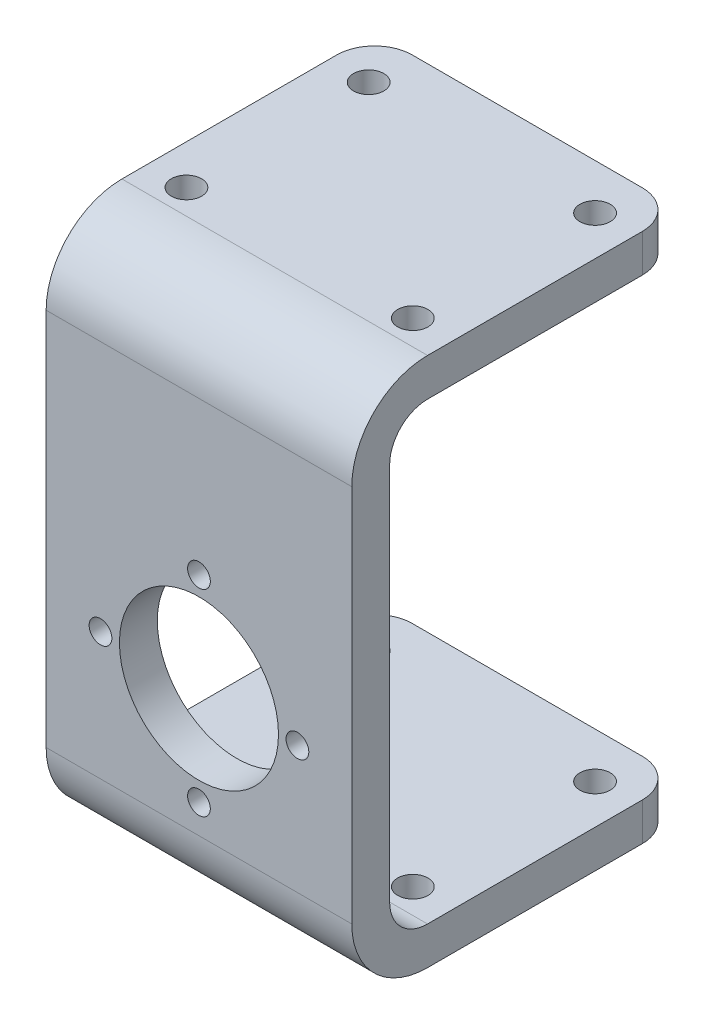
ISO-10303-21;
HEADER;
FILE_DESCRIPTION(('STEP AP214'),'2;1');
FILE_NAME('part.step','',(''),(''),'','','');
FILE_SCHEMA(('AUTOMOTIVE_DESIGN { 1 0 10303 214 1 1 1 1 }'));
ENDSEC;
DATA;
#1=APPLICATION_CONTEXT('core data for automotive mechanical design processes');
#2=APPLICATION_PROTOCOL_DEFINITION('international standard','automotive_design',2000,#1);
#3=PRODUCT_CONTEXT('',#1,'mechanical');
#4=PRODUCT('Part','Part','',(#3));
#5=PRODUCT_RELATED_PRODUCT_CATEGORY('part','',(#4));
#6=PRODUCT_DEFINITION_FORMATION('','',#4);
#7=PRODUCT_DEFINITION_CONTEXT('part definition',#1,'design');
#8=PRODUCT_DEFINITION('design','',#6,#7);
#9=PRODUCT_DEFINITION_SHAPE('','',#8);
#10=(LENGTH_UNIT() NAMED_UNIT(*) SI_UNIT(.MILLI.,.METRE.));
#11=(NAMED_UNIT(*) PLANE_ANGLE_UNIT() SI_UNIT($,.RADIAN.));
#12=(NAMED_UNIT(*) SI_UNIT($,.STERADIAN.) SOLID_ANGLE_UNIT());
#13=UNCERTAINTY_MEASURE_WITH_UNIT(LENGTH_MEASURE(1.E-05),#10,'distance_accuracy_value','');
#14=(GEOMETRIC_REPRESENTATION_CONTEXT(3) GLOBAL_UNCERTAINTY_ASSIGNED_CONTEXT((#13)) GLOBAL_UNIT_ASSIGNED_CONTEXT((#10,
#11,#12)) REPRESENTATION_CONTEXT('',''));
#15=CARTESIAN_POINT('',(0.,0.,0.));
#16=DIRECTION('',(0.,0.,1.));
#17=DIRECTION('',(1.,0.,0.));
#18=AXIS2_PLACEMENT_3D('',#15,#16,#17);
#19=CARTESIAN_POINT('',(-47.1412127925836,47.,50.783023222912));
#20=DIRECTION('',(0.,0.,-1.));
#21=DIRECTION('',(-1.,0.,0.));
#22=AXIS2_PLACEMENT_3D('',#19,#20,#21);
#23=PLANE('',#22);
#24=CARTESIAN_POINT('',(-26.9662127925835,39.8250000000002,50.783023222912));
#25=DIRECTION('',(0.,0.,1.));
#26=DIRECTION('',(1.,0.,0.));
#27=AXIS2_PLACEMENT_3D('',#24,#25,#26);
#28=CIRCLE('',#27,1.49999999999991);
#29=CARTESIAN_POINT('',(-25.4662127925835,39.8250000000002,50.783023222912));
#30=VERTEX_POINT('',#29);
#31=EDGE_CURVE('E604',#30,#30,#28,.T.);
#32=ORIENTED_EDGE('',*,*,#31,.F.);
#33=EDGE_LOOP('',(#32));
#34=FACE_BOUND('',#33,.T.);
#35=CARTESIAN_POINT('',(-26.9662127925833,13.825,50.783023222912));
#36=DIRECTION('',(0.,0.,1.));
#37=DIRECTION('',(1.,0.,0.));
#38=AXIS2_PLACEMENT_3D('',#35,#36,#37);
#39=CIRCLE('',#38,1.5);
#40=CARTESIAN_POINT('',(-25.4662127925833,13.825,50.783023222912));
#41=VERTEX_POINT('',#40);
#42=EDGE_CURVE('E369',#41,#41,#39,.T.);
#43=ORIENTED_EDGE('',*,*,#42,.F.);
#44=EDGE_LOOP('',(#43));
#45=FACE_BOUND('',#44,.T.);
#46=CARTESIAN_POINT('',(-39.9662127925834,26.8249999999999,50.783023222912));
#47=DIRECTION('',(0.,0.,1.));
#48=DIRECTION('',(1.,0.,0.));
#49=AXIS2_PLACEMENT_3D('',#46,#47,#48);
#50=CIRCLE('',#49,1.5);
#51=CARTESIAN_POINT('',(-38.4662127925834,26.8249999999999,50.783023222912));
#52=VERTEX_POINT('',#51);
#53=EDGE_CURVE('E371',#52,#52,#50,.T.);
#54=ORIENTED_EDGE('',*,*,#53,.F.);
#55=EDGE_LOOP('',(#54));
#56=FACE_BOUND('',#55,.T.);
#57=CARTESIAN_POINT('',(-26.9662127925836,26.825,50.783023222912));
#58=DIRECTION('',(0.,0.,1.));
#59=DIRECTION('',(1.,0.,0.));
#60=AXIS2_PLACEMENT_3D('',#57,#58,#59);
#61=CIRCLE('',#60,10.5);
#62=CARTESIAN_POINT('',(-16.4662127925836,26.825,50.783023222912));
#63=VERTEX_POINT('',#62);
#64=EDGE_CURVE('E275',#63,#63,#61,.T.);
#65=ORIENTED_EDGE('',*,*,#64,.F.);
#66=EDGE_LOOP('',(#65));
#67=FACE_BOUND('',#66,.T.);
#68=CARTESIAN_POINT('',(-13.9662127925834,26.8250000000001,50.783023222912));
#69=DIRECTION('',(0.,0.,1.));
#70=DIRECTION('',(1.,0.,0.));
#71=AXIS2_PLACEMENT_3D('',#68,#69,#70);
#72=CIRCLE('',#71,1.5);
#73=CARTESIAN_POINT('',(-12.4662127925834,26.8250000000001,50.783023222912));
#74=VERTEX_POINT('',#73);
#75=EDGE_CURVE('E375',#74,#74,#72,.T.);
#76=ORIENTED_EDGE('',*,*,#75,.F.);
#77=EDGE_LOOP('',(#76));
#78=FACE_BOUND('',#77,.T.);
#79=DIRECTION('',(1.,0.,0.));
#80=VECTOR('',#79,1.);
#81=CARTESIAN_POINT('',(-56.7912127925836,59.9971782264075,50.783023222912));
#82=LINE('',#81,#80);
#83=CARTESIAN_POINT('',(-47.1412127925836,59.9971782264075,50.783023222912));
#84=VERTEX_POINT('',#83);
#85=CARTESIAN_POINT('',(-6.79121279258359,59.9971782264075,50.783023222912));
#86=VERTEX_POINT('',#85);
#87=EDGE_CURVE('E184',#84,#86,#82,.T.);
#88=ORIENTED_EDGE('',*,*,#87,.F.);
#89=DIRECTION('',(0.,-1.,0.));
#90=VECTOR('',#89,1.);
#91=CARTESIAN_POINT('',(-47.1412127925836,47.,50.783023222912));
#92=LINE('',#91,#90);
#93=CARTESIAN_POINT('',(-47.1412127925836,10.,50.783023222912));
#94=VERTEX_POINT('',#93);
#95=EDGE_CURVE('E212',#84,#94,#92,.T.);
#96=ORIENTED_EDGE('',*,*,#95,.T.);
#97=DIRECTION('',(1.,0.,0.));
#98=VECTOR('',#97,1.);
#99=CARTESIAN_POINT('',(-47.1412127925836,10.,50.783023222912));
#100=LINE('',#99,#98);
#101=CARTESIAN_POINT('',(-6.79121279258359,10.,50.783023222912));
#102=VERTEX_POINT('',#101);
#103=EDGE_CURVE('E210',#94,#102,#100,.T.);
#104=ORIENTED_EDGE('',*,*,#103,.T.);
#105=DIRECTION('',(0.,-1.,0.));
#106=VECTOR('',#105,1.);
#107=CARTESIAN_POINT('',(-6.79121279258359,47.,50.783023222912));
#108=LINE('',#107,#106);
#109=EDGE_CURVE('E201',#86,#102,#108,.T.);
#110=ORIENTED_EDGE('',*,*,#109,.F.);
#111=EDGE_LOOP('',(#88,#96,#104,#110));
#112=FACE_BOUND('',#111,.T.);
#113=ADVANCED_FACE('F68',(#34,#45,#56,#67,#78,#112),#23,.F.);
#114=CARTESIAN_POINT('',(-47.1412127925836,47.,7.43302322291196));
#115=DIRECTION('',(1.,0.,0.));
#116=DIRECTION('',(0.,0.,-1.));
#117=AXIS2_PLACEMENT_3D('',#114,#115,#116);
#118=PLANE('',#117);
#119=DIRECTION('',(0.,0.,-1.));
#120=VECTOR('',#119,1.);
#121=CARTESIAN_POINT('',(-47.1412127925836,70.,50.783023222912));
#122=LINE('',#121,#120);
#123=CARTESIAN_POINT('',(-47.1412127925836,70.,40.7802014493195));
#124=VERTEX_POINT('',#123);
#125=CARTESIAN_POINT('',(-47.1412127925836,70.,12.433023222912));
#126=VERTEX_POINT('',#125);
#127=EDGE_CURVE('E357',#124,#126,#122,.T.);
#128=ORIENTED_EDGE('',*,*,#127,.T.);
#129=DIRECTION('',(0.,-1.,0.));
#130=VECTOR('',#129,1.);
#131=CARTESIAN_POINT('',(-47.1412127925836,47.,12.433023222912));
#132=LINE('',#131,#130);
#133=CARTESIAN_POINT('',(-47.1412127925836,65.0000022878821,12.433023222912));
#134=VERTEX_POINT('',#133);
#135=EDGE_CURVE('E12',#126,#134,#132,.T.);
#136=ORIENTED_EDGE('',*,*,#135,.T.);
#137=DIRECTION('',(0.,0.,1.));
#138=VECTOR('',#137,1.);
#139=CARTESIAN_POINT('',(-47.1412127925836,65.0000022878821,7.43302322291196));
#140=LINE('',#139,#138);
#141=CARTESIAN_POINT('',(-47.1412127925836,65.0000022878821,40.7778088979855));
#142=VERTEX_POINT('',#141);
#143=EDGE_CURVE('E474',#134,#142,#140,.T.);
#144=ORIENTED_EDGE('',*,*,#143,.T.);
#145=CARTESIAN_POINT('',(-47.1412127925836,59.9947856750735,40.7778088979856));
#146=DIRECTION('',(1.,0.,0.));
#147=DIRECTION('',(0.,0.,-1.));
#148=AXIS2_PLACEMENT_3D('',#145,#146,#147);
#149=CIRCLE('',#148,5.00521661280863);
#150=CARTESIAN_POINT('',(-47.1412127925836,59.9995713501471,45.7830232229121));
#151=VERTEX_POINT('',#150);
#152=EDGE_CURVE('E293',#142,#151,#149,.T.);
#153=ORIENTED_EDGE('',*,*,#152,.T.);
#154=DIRECTION('',(0.,1.,0.));
#155=VECTOR('',#154,1.);
#156=CARTESIAN_POINT('',(-47.1412127925836,0.,45.783023222912));
#157=LINE('',#156,#155);
#158=CARTESIAN_POINT('',(-47.1412127925836,10.,45.783023222912));
#159=VERTEX_POINT('',#158);
#160=EDGE_CURVE('E388',#159,#151,#157,.T.);
#161=ORIENTED_EDGE('',*,*,#160,.F.);
#162=CARTESIAN_POINT('',(-47.1412127925836,10.,40.783023222912));
#163=DIRECTION('',(-1.,0.,0.));
#164=DIRECTION('',(0.,0.,1.));
#165=AXIS2_PLACEMENT_3D('',#162,#163,#164);
#166=CIRCLE('',#165,5.);
#167=CARTESIAN_POINT('',(-47.1412127925836,5.,40.783023222912));
#168=VERTEX_POINT('',#167);
#169=EDGE_CURVE('E287',#168,#159,#166,.T.);
#170=ORIENTED_EDGE('',*,*,#169,.F.);
#171=DIRECTION('',(0.,0.,1.));
#172=VECTOR('',#171,1.);
#173=CARTESIAN_POINT('',(-47.1412127925836,5.,0.));
#174=LINE('',#173,#172);
#175=CARTESIAN_POINT('',(-47.1412127925836,5.,12.433023222912));
#176=VERTEX_POINT('',#175);
#177=EDGE_CURVE('E391',#176,#168,#174,.T.);
#178=ORIENTED_EDGE('',*,*,#177,.F.);
#179=DIRECTION('',(0.,-1.,0.));
#180=VECTOR('',#179,1.);
#181=CARTESIAN_POINT('',(-47.1412127925836,47.,12.433023222912));
#182=LINE('',#181,#180);
#183=CARTESIAN_POINT('',(-47.1412127925836,0.,12.433023222912));
#184=VERTEX_POINT('',#183);
#185=EDGE_CURVE('E265',#176,#184,#182,.T.);
#186=ORIENTED_EDGE('',*,*,#185,.T.);
#187=DIRECTION('',(0.,0.,1.));
#188=VECTOR('',#187,1.);
#189=CARTESIAN_POINT('',(-47.1412127925836,0.,7.43302322291196));
#190=LINE('',#189,#188);
#191=CARTESIAN_POINT('',(-47.1412127925836,0.,40.783023222912));
#192=VERTEX_POINT('',#191);
#193=EDGE_CURVE('E408',#184,#192,#190,.T.);
#194=ORIENTED_EDGE('',*,*,#193,.T.);
#195=CARTESIAN_POINT('',(-47.1412127925836,10.,40.783023222912));
#196=DIRECTION('',(1.,0.,0.));
#197=DIRECTION('',(0.,0.,-1.));
#198=AXIS2_PLACEMENT_3D('',#195,#196,#197);
#199=CIRCLE('',#198,10.);
#200=EDGE_CURVE('E232',#192,#94,#199,.F.);
#201=ORIENTED_EDGE('',*,*,#200,.T.);
#202=ORIENTED_EDGE('',*,*,#95,.F.);
#203=CARTESIAN_POINT('',(-47.1412127925836,59.9971782264075,40.7802014493195));
#204=DIRECTION('',(1.,0.,0.));
#205=DIRECTION('',(0.,0.,-1.));
#206=AXIS2_PLACEMENT_3D('',#203,#204,#205);
#207=CIRCLE('',#206,10.0028217735925);
#208=EDGE_CURVE('E190',#124,#84,#207,.T.);
#209=ORIENTED_EDGE('',*,*,#208,.F.);
#210=EDGE_LOOP('',(#128,#136,#144,#153,#161,#170,#178,#186,#194,#201,#202,#209));
#211=FACE_BOUND('',#210,.T.);
#212=ADVANCED_FACE('F436',(#211),#118,.F.);
#213=CARTESIAN_POINT('',(-6.7912127925836,47.,7.43302322291196));
#214=DIRECTION('',(-1.,0.,0.));
#215=DIRECTION('',(0.,0.,1.));
#216=AXIS2_PLACEMENT_3D('',#213,#214,#215);
#217=PLANE('',#216);
#218=DIRECTION('',(0.,0.,1.));
#219=VECTOR('',#218,1.);
#220=CARTESIAN_POINT('',(-6.7912127925836,65.0000022878821,0.));
#221=LINE('',#220,#219);
#222=CARTESIAN_POINT('',(-6.7912127925836,65.0000022878821,12.433023222912));
#223=VERTEX_POINT('',#222);
#224=CARTESIAN_POINT('',(-6.7912127925836,65.0000022878821,40.7778088979855));
#225=VERTEX_POINT('',#224);
#226=EDGE_CURVE('E195',#223,#225,#221,.T.);
#227=ORIENTED_EDGE('',*,*,#226,.F.);
#228=DIRECTION('',(0.,1.,0.));
#229=VECTOR('',#228,1.);
#230=CARTESIAN_POINT('',(-6.7912127925836,47.,12.433023222912));
#231=LINE('',#230,#229);
#232=CARTESIAN_POINT('',(-6.7912127925836,70.,12.433023222912));
#233=VERTEX_POINT('',#232);
#234=EDGE_CURVE('E320',#223,#233,#231,.T.);
#235=ORIENTED_EDGE('',*,*,#234,.T.);
#236=DIRECTION('',(0.,0.,-1.));
#237=VECTOR('',#236,1.);
#238=CARTESIAN_POINT('',(-6.79121279258359,70.,50.783023222912));
#239=LINE('',#238,#237);
#240=CARTESIAN_POINT('',(-6.7912127925836,70.,40.7802014493195));
#241=VERTEX_POINT('',#240);
#242=EDGE_CURVE('E205',#241,#233,#239,.T.);
#243=ORIENTED_EDGE('',*,*,#242,.F.);
#244=CARTESIAN_POINT('',(-6.7912127925836,59.9971782264075,40.7802014493195));
#245=DIRECTION('',(1.,0.,0.));
#246=DIRECTION('',(0.,0.,-1.));
#247=AXIS2_PLACEMENT_3D('',#244,#245,#246);
#248=CIRCLE('',#247,10.0028217735925);
#249=EDGE_CURVE('E187',#241,#86,#248,.T.);
#250=ORIENTED_EDGE('',*,*,#249,.T.);
#251=ORIENTED_EDGE('',*,*,#109,.T.);
#252=CARTESIAN_POINT('',(-6.79121279258359,10.,40.783023222912));
#253=DIRECTION('',(-1.,0.,0.));
#254=DIRECTION('',(0.,0.,1.));
#255=AXIS2_PLACEMENT_3D('',#252,#253,#254);
#256=CIRCLE('',#255,10.);
#257=CARTESIAN_POINT('',(-6.7912127925836,0.,40.783023222912));
#258=VERTEX_POINT('',#257);
#259=EDGE_CURVE('E225',#102,#258,#256,.F.);
#260=ORIENTED_EDGE('',*,*,#259,.T.);
#261=DIRECTION('',(0.,0.,-1.));
#262=VECTOR('',#261,1.);
#263=CARTESIAN_POINT('',(-6.7912127925836,0.,7.43302322291196));
#264=LINE('',#263,#262);
#265=CARTESIAN_POINT('',(-6.7912127925836,0.,12.433023222912));
#266=VERTEX_POINT('',#265);
#267=EDGE_CURVE('E219',#258,#266,#264,.T.);
#268=ORIENTED_EDGE('',*,*,#267,.T.);
#269=DIRECTION('',(0.,-1.,0.));
#270=VECTOR('',#269,1.);
#271=CARTESIAN_POINT('',(-6.7912127925836,47.,12.433023222912));
#272=LINE('',#271,#270);
#273=CARTESIAN_POINT('',(-6.7912127925836,5.,12.433023222912));
#274=VERTEX_POINT('',#273);
#275=EDGE_CURVE('E256',#266,#274,#272,.F.);
#276=ORIENTED_EDGE('',*,*,#275,.T.);
#277=DIRECTION('',(0.,0.,1.));
#278=VECTOR('',#277,1.);
#279=CARTESIAN_POINT('',(-6.7912127925836,5.,7.43302322291196));
#280=LINE('',#279,#278);
#281=CARTESIAN_POINT('',(-6.7912127925836,5.,40.783023222912));
#282=VERTEX_POINT('',#281);
#283=EDGE_CURVE('E240',#274,#282,#280,.T.);
#284=ORIENTED_EDGE('',*,*,#283,.T.);
#285=CARTESIAN_POINT('',(-6.79121279258359,10.,40.783023222912));
#286=DIRECTION('',(-1.,0.,0.));
#287=DIRECTION('',(0.,0.,1.));
#288=AXIS2_PLACEMENT_3D('',#285,#286,#287);
#289=CIRCLE('',#288,5.);
#290=CARTESIAN_POINT('',(-6.79121279258359,10.,45.783023222912));
#291=VERTEX_POINT('',#290);
#292=EDGE_CURVE('E236',#282,#291,#289,.T.);
#293=ORIENTED_EDGE('',*,*,#292,.T.);
#294=DIRECTION('',(0.,1.,0.));
#295=VECTOR('',#294,1.);
#296=CARTESIAN_POINT('',(-6.7912127925836,47.,45.783023222912));
#297=LINE('',#296,#295);
#298=CARTESIAN_POINT('',(-6.79121279258359,59.9995713501471,45.7830232229121));
#299=VERTEX_POINT('',#298);
#300=EDGE_CURVE('E399',#291,#299,#297,.T.);
#301=ORIENTED_EDGE('',*,*,#300,.T.);
#302=CARTESIAN_POINT('',(-6.7912127925836,59.9947856750735,40.7778088979856));
#303=DIRECTION('',(1.,0.,0.));
#304=DIRECTION('',(0.,0.,-1.));
#305=AXIS2_PLACEMENT_3D('',#302,#303,#304);
#306=CIRCLE('',#305,5.00521661280863);
#307=EDGE_CURVE('E346',#225,#299,#306,.T.);
#308=ORIENTED_EDGE('',*,*,#307,.F.);
#309=EDGE_LOOP('',(#227,#235,#243,#250,#251,#260,#268,#276,#284,#293,#301,#308));
#310=FACE_BOUND('',#309,.T.);
#311=ADVANCED_FACE('F200',(#310),#217,.F.);
#312=CARTESIAN_POINT('',(-6.79121279258359,70.,50.783023222912));
#313=DIRECTION('',(0.,1.,0.));
#314=DIRECTION('',(0.,0.,1.));
#315=AXIS2_PLACEMENT_3D('',#312,#313,#314);
#316=PLANE('',#315);
#317=CARTESIAN_POINT('',(-41.9112127925836,70.,37.493023222912));
#318=DIRECTION('',(0.,1.,0.));
#319=DIRECTION('',(0.,0.,1.));
#320=AXIS2_PLACEMENT_3D('',#317,#318,#319);
#321=CIRCLE('',#320,2.);
#322=CARTESIAN_POINT('',(-41.9112127925836,70.,39.493023222912));
#323=VERTEX_POINT('',#322);
#324=EDGE_CURVE('E306',#323,#323,#321,.F.);
#325=ORIENTED_EDGE('',*,*,#324,.T.);
#326=EDGE_LOOP('',(#325));
#327=FACE_BOUND('',#326,.T.);
#328=CARTESIAN_POINT('',(-12.0212127925836,70.,13.433023222912));
#329=DIRECTION('',(0.,1.,0.));
#330=DIRECTION('',(0.,0.,1.));
#331=AXIS2_PLACEMENT_3D('',#328,#329,#330);
#332=CIRCLE('',#331,2.);
#333=CARTESIAN_POINT('',(-12.0212127925836,70.,15.433023222912));
#334=VERTEX_POINT('',#333);
#335=EDGE_CURVE('E300',#334,#334,#332,.F.);
#336=ORIENTED_EDGE('',*,*,#335,.T.);
#337=EDGE_LOOP('',(#336));
#338=FACE_BOUND('',#337,.T.);
#339=CARTESIAN_POINT('',(-41.9112127925836,70.,13.433023222912));
#340=DIRECTION('',(0.,1.,0.));
#341=DIRECTION('',(0.,0.,1.));
#342=AXIS2_PLACEMENT_3D('',#339,#340,#341);
#343=CIRCLE('',#342,2.);
#344=CARTESIAN_POINT('',(-41.9112127925836,70.,15.433023222912));
#345=VERTEX_POINT('',#344);
#346=EDGE_CURVE('E294',#345,#345,#343,.F.);
#347=ORIENTED_EDGE('',*,*,#346,.T.);
#348=EDGE_LOOP('',(#347));
#349=FACE_BOUND('',#348,.T.);
#350=CARTESIAN_POINT('',(-12.0212127925836,70.,37.493023222912));
#351=DIRECTION('',(0.,1.,0.));
#352=DIRECTION('',(0.,0.,1.));
#353=AXIS2_PLACEMENT_3D('',#350,#351,#352);
#354=CIRCLE('',#353,2.);
#355=CARTESIAN_POINT('',(-12.0212127925836,70.,39.493023222912));
#356=VERTEX_POINT('',#355);
#357=EDGE_CURVE('E288',#356,#356,#354,.F.);
#358=ORIENTED_EDGE('',*,*,#357,.T.);
#359=EDGE_LOOP('',(#358));
#360=FACE_BOUND('',#359,.T.);
#361=ORIENTED_EDGE('',*,*,#242,.T.);
#362=CARTESIAN_POINT('',(-11.7912127925836,70.,12.433023222912));
#363=DIRECTION('',(0.,1.,0.));
#364=DIRECTION('',(0.,0.,1.));
#365=AXIS2_PLACEMENT_3D('',#362,#363,#364);
#366=CIRCLE('',#365,5.);
#367=CARTESIAN_POINT('',(-11.7912127925836,70.,7.43302322291196));
#368=VERTEX_POINT('',#367);
#369=EDGE_CURVE('E326',#233,#368,#366,.T.);
#370=ORIENTED_EDGE('',*,*,#369,.T.);
#371=DIRECTION('',(-1.,0.,0.));
#372=VECTOR('',#371,1.);
#373=CARTESIAN_POINT('',(-6.79121279258361,70.,7.43302322291196));
#374=LINE('',#373,#372);
#375=CARTESIAN_POINT('',(-42.1412127925836,70.,7.43302322291196));
#376=VERTEX_POINT('',#375);
#377=EDGE_CURVE('E353',#368,#376,#374,.T.);
#378=ORIENTED_EDGE('',*,*,#377,.T.);
#379=CARTESIAN_POINT('',(-42.1412127925836,70.,12.433023222912));
#380=DIRECTION('',(0.,1.,0.));
#381=DIRECTION('',(0.,0.,1.));
#382=AXIS2_PLACEMENT_3D('',#379,#380,#381);
#383=CIRCLE('',#382,5.);
#384=EDGE_CURVE('E323',#376,#126,#383,.T.);
#385=ORIENTED_EDGE('',*,*,#384,.T.);
#386=ORIENTED_EDGE('',*,*,#127,.F.);
#387=DIRECTION('',(1.,0.,0.));
#388=VECTOR('',#387,1.);
#389=CARTESIAN_POINT('',(-56.7912127925836,70.,40.7802014493195));
#390=LINE('',#389,#388);
#391=EDGE_CURVE('E269',#124,#241,#390,.T.);
#392=ORIENTED_EDGE('',*,*,#391,.T.);
#393=EDGE_LOOP('',(#361,#370,#378,#385,#386,#392));
#394=FACE_BOUND('',#393,.T.);
#395=ADVANCED_FACE('F352',(#327,#338,#349,#360,#394),#316,.T.);
#396=CARTESIAN_POINT('',(-47.1412127925836,47.,7.43302322291196));
#397=DIRECTION('',(0.,0.,1.));
#398=DIRECTION('',(1.,0.,0.));
#399=AXIS2_PLACEMENT_3D('',#396,#397,#398);
#400=PLANE('',#399);
#401=DIRECTION('',(1.,0.,0.));
#402=VECTOR('',#401,1.);
#403=CARTESIAN_POINT('',(-47.1412127925836,5.,7.43302322291196));
#404=LINE('',#403,#402);
#405=CARTESIAN_POINT('',(-42.1412127925836,5.,7.43302322291196));
#406=VERTEX_POINT('',#405);
#407=CARTESIAN_POINT('',(-11.7912127925836,5.,7.43302322291196));
#408=VERTEX_POINT('',#407);
#409=EDGE_CURVE('E404',#406,#408,#404,.T.);
#410=ORIENTED_EDGE('',*,*,#409,.T.);
#411=DIRECTION('',(0.,-1.,0.));
#412=VECTOR('',#411,1.);
#413=CARTESIAN_POINT('',(-11.7912127925836,47.,7.43302322291196));
#414=LINE('',#413,#412);
#415=CARTESIAN_POINT('',(-11.7912127925836,0.,7.43302322291196));
#416=VERTEX_POINT('',#415);
#417=EDGE_CURVE('E246',#408,#416,#414,.T.);
#418=ORIENTED_EDGE('',*,*,#417,.T.);
#419=DIRECTION('',(-1.,0.,0.));
#420=VECTOR('',#419,1.);
#421=CARTESIAN_POINT('',(-47.1412127925836,0.,7.43302322291196));
#422=LINE('',#421,#420);
#423=CARTESIAN_POINT('',(-42.1412127925836,0.,7.43302322291196));
#424=VERTEX_POINT('',#423);
#425=EDGE_CURVE('E213',#416,#424,#422,.T.);
#426=ORIENTED_EDGE('',*,*,#425,.T.);
#427=DIRECTION('',(0.,-1.,0.));
#428=VECTOR('',#427,1.);
#429=CARTESIAN_POINT('',(-42.1412127925836,47.,7.43302322291196));
#430=LINE('',#429,#428);
#431=EDGE_CURVE('E243',#424,#406,#430,.F.);
#432=ORIENTED_EDGE('',*,*,#431,.T.);
#433=EDGE_LOOP('',(#410,#418,#426,#432));
#434=FACE_BOUND('',#433,.T.);
#435=ADVANCED_FACE('F427',(#434),#400,.F.);
#436=CARTESIAN_POINT('',(0.,0.,0.));
#437=DIRECTION('',(0.,1.,0.));
#438=DIRECTION('',(0.,0.,1.));
#439=AXIS2_PLACEMENT_3D('',#436,#437,#438);
#440=PLANE('',#439);
#441=CARTESIAN_POINT('',(-41.9112127925836,0.,37.493023222912));
#442=DIRECTION('',(0.,1.,0.));
#443=DIRECTION('',(0.,0.,1.));
#444=AXIS2_PLACEMENT_3D('',#441,#442,#443);
#445=CIRCLE('',#444,2.);
#446=CARTESIAN_POINT('',(-41.9112127925836,0.,39.493023222912));
#447=VERTEX_POINT('',#446);
#448=EDGE_CURVE('E358',#447,#447,#445,.F.);
#449=ORIENTED_EDGE('',*,*,#448,.F.);
#450=EDGE_LOOP('',(#449));
#451=FACE_BOUND('',#450,.T.);
#452=CARTESIAN_POINT('',(-12.0212127925836,0.,13.433023222912));
#453=DIRECTION('',(0.,1.,0.));
#454=DIRECTION('',(0.,0.,1.));
#455=AXIS2_PLACEMENT_3D('',#452,#453,#454);
#456=CIRCLE('',#455,2.);
#457=CARTESIAN_POINT('',(-12.0212127925836,0.,15.433023222912));
#458=VERTEX_POINT('',#457);
#459=EDGE_CURVE('E311',#458,#458,#456,.F.);
#460=ORIENTED_EDGE('',*,*,#459,.F.);
#461=EDGE_LOOP('',(#460));
#462=FACE_BOUND('',#461,.T.);
#463=CARTESIAN_POINT('',(-41.9112127925836,0.,13.433023222912));
#464=DIRECTION('',(0.,1.,0.));
#465=DIRECTION('',(0.,0.,1.));
#466=AXIS2_PLACEMENT_3D('',#463,#464,#465);
#467=CIRCLE('',#466,2.);
#468=CARTESIAN_POINT('',(-41.9112127925836,0.,15.433023222912));
#469=VERTEX_POINT('',#468);
#470=EDGE_CURVE('E305',#469,#469,#467,.F.);
#471=ORIENTED_EDGE('',*,*,#470,.F.);
#472=EDGE_LOOP('',(#471));
#473=FACE_BOUND('',#472,.T.);
#474=CARTESIAN_POINT('',(-12.0212127925836,0.,37.493023222912));
#475=DIRECTION('',(0.,1.,0.));
#476=DIRECTION('',(0.,0.,1.));
#477=AXIS2_PLACEMENT_3D('',#474,#475,#476);
#478=CIRCLE('',#477,2.);
#479=CARTESIAN_POINT('',(-12.0212127925836,0.,39.493023222912));
#480=VERTEX_POINT('',#479);
#481=EDGE_CURVE('E299',#480,#480,#478,.F.);
#482=ORIENTED_EDGE('',*,*,#481,.F.);
#483=EDGE_LOOP('',(#482));
#484=FACE_BOUND('',#483,.T.);
#485=ORIENTED_EDGE('',*,*,#425,.F.);
#486=CARTESIAN_POINT('',(-11.7912127925836,0.,12.433023222912));
#487=DIRECTION('',(0.,1.,0.));
#488=DIRECTION('',(0.,0.,1.));
#489=AXIS2_PLACEMENT_3D('',#486,#487,#488);
#490=CIRCLE('',#489,5.);
#491=EDGE_CURVE('E253',#416,#266,#490,.F.);
#492=ORIENTED_EDGE('',*,*,#491,.T.);
#493=ORIENTED_EDGE('',*,*,#267,.F.);
#494=DIRECTION('',(1.,0.,0.));
#495=VECTOR('',#494,1.);
#496=CARTESIAN_POINT('',(0.,0.,40.783023222912));
#497=LINE('',#496,#495);
#498=EDGE_CURVE('E228',#258,#192,#497,.F.);
#499=ORIENTED_EDGE('',*,*,#498,.T.);
#500=ORIENTED_EDGE('',*,*,#193,.F.);
#501=CARTESIAN_POINT('',(-42.1412127925836,0.,12.433023222912));
#502=DIRECTION('',(0.,1.,0.));
#503=DIRECTION('',(0.,0.,1.));
#504=AXIS2_PLACEMENT_3D('',#501,#502,#503);
#505=CIRCLE('',#504,5.);
#506=EDGE_CURVE('E250',#184,#424,#505,.F.);
#507=ORIENTED_EDGE('',*,*,#506,.T.);
#508=EDGE_LOOP('',(#485,#492,#493,#499,#500,#507));
#509=FACE_BOUND('',#508,.T.);
#510=ADVANCED_FACE('F523',(#451,#462,#473,#484,#509),#440,.F.);
#511=CARTESIAN_POINT('',(-47.1412127925836,10.,40.783023222912));
#512=DIRECTION('',(1.,0.,0.));
#513=DIRECTION('',(0.,0.,-1.));
#514=AXIS2_PLACEMENT_3D('',#511,#512,#513);
#515=CYLINDRICAL_SURFACE('',#514,10.);
#516=ORIENTED_EDGE('',*,*,#200,.F.);
#517=ORIENTED_EDGE('',*,*,#498,.F.);
#518=ORIENTED_EDGE('',*,*,#259,.F.);
#519=ORIENTED_EDGE('',*,*,#103,.F.);
#520=EDGE_LOOP('',(#516,#517,#518,#519));
#521=FACE_BOUND('',#520,.T.);
#522=ADVANCED_FACE('F525',(#521),#515,.T.);
#523=CARTESIAN_POINT('',(54.8587872074164,10.,40.783023222912));
#524=DIRECTION('',(-1.,0.,0.));
#525=DIRECTION('',(0.,0.,1.));
#526=AXIS2_PLACEMENT_3D('',#523,#524,#525);
#527=CYLINDRICAL_SURFACE('',#526,5.);
#528=DIRECTION('',(-1.,0.,0.));
#529=VECTOR('',#528,1.);
#530=CARTESIAN_POINT('',(54.8587872074164,5.,40.783023222912));
#531=LINE('',#530,#529);
#532=EDGE_CURVE('E395',#282,#168,#531,.T.);
#533=ORIENTED_EDGE('',*,*,#532,.T.);
#534=ORIENTED_EDGE('',*,*,#169,.T.);
#535=DIRECTION('',(-1.,0.,0.));
#536=VECTOR('',#535,1.);
#537=CARTESIAN_POINT('',(54.8587872074164,10.,45.783023222912));
#538=LINE('',#537,#536);
#539=EDGE_CURVE('E394',#291,#159,#538,.T.);
#540=ORIENTED_EDGE('',*,*,#539,.F.);
#541=ORIENTED_EDGE('',*,*,#292,.F.);
#542=EDGE_LOOP('',(#533,#534,#540,#541));
#543=FACE_BOUND('',#542,.T.);
#544=ADVANCED_FACE('F442',(#543),#527,.F.);
#545=CARTESIAN_POINT('',(54.8587872074164,5.,0.));
#546=DIRECTION('',(0.,-1.,0.));
#547=DIRECTION('',(0.,0.,-1.));
#548=AXIS2_PLACEMENT_3D('',#545,#546,#547);
#549=PLANE('',#548);
#550=CARTESIAN_POINT('',(-41.9112127925836,5.,37.493023222912));
#551=DIRECTION('',(0.,-1.,0.));
#552=DIRECTION('',(0.,0.,-1.));
#553=AXIS2_PLACEMENT_3D('',#550,#551,#552);
#554=CIRCLE('',#553,2.);
#555=CARTESIAN_POINT('',(-41.9112127925836,5.,35.493023222912));
#556=VERTEX_POINT('',#555);
#557=EDGE_CURVE('E310',#556,#556,#554,.F.);
#558=ORIENTED_EDGE('',*,*,#557,.F.);
#559=EDGE_LOOP('',(#558));
#560=FACE_BOUND('',#559,.T.);
#561=CARTESIAN_POINT('',(-12.0212127925836,5.,13.433023222912));
#562=DIRECTION('',(0.,-1.,0.));
#563=DIRECTION('',(0.,0.,-1.));
#564=AXIS2_PLACEMENT_3D('',#561,#562,#563);
#565=CIRCLE('',#564,2.);
#566=CARTESIAN_POINT('',(-12.0212127925836,5.,11.433023222912));
#567=VERTEX_POINT('',#566);
#568=EDGE_CURVE('E304',#567,#567,#565,.F.);
#569=ORIENTED_EDGE('',*,*,#568,.F.);
#570=EDGE_LOOP('',(#569));
#571=FACE_BOUND('',#570,.T.);
#572=CARTESIAN_POINT('',(-41.9112127925836,5.,13.433023222912));
#573=DIRECTION('',(0.,-1.,0.));
#574=DIRECTION('',(0.,0.,-1.));
#575=AXIS2_PLACEMENT_3D('',#572,#573,#574);
#576=CIRCLE('',#575,2.);
#577=CARTESIAN_POINT('',(-41.9112127925836,5.,11.433023222912));
#578=VERTEX_POINT('',#577);
#579=EDGE_CURVE('E298',#578,#578,#576,.F.);
#580=ORIENTED_EDGE('',*,*,#579,.F.);
#581=EDGE_LOOP('',(#580));
#582=FACE_BOUND('',#581,.T.);
#583=CARTESIAN_POINT('',(-12.0212127925836,5.,37.493023222912));
#584=DIRECTION('',(0.,-1.,0.));
#585=DIRECTION('',(0.,0.,-1.));
#586=AXIS2_PLACEMENT_3D('',#583,#584,#585);
#587=CIRCLE('',#586,2.);
#588=CARTESIAN_POINT('',(-12.0212127925836,5.,35.493023222912));
#589=VERTEX_POINT('',#588);
#590=EDGE_CURVE('E292',#589,#589,#587,.F.);
#591=ORIENTED_EDGE('',*,*,#590,.F.);
#592=EDGE_LOOP('',(#591));
#593=FACE_BOUND('',#592,.T.);
#594=ORIENTED_EDGE('',*,*,#283,.F.);
#595=CARTESIAN_POINT('',(-11.7912127925836,5.,12.433023222912));
#596=DIRECTION('',(0.,-1.,0.));
#597=DIRECTION('',(0.,0.,-1.));
#598=AXIS2_PLACEMENT_3D('',#595,#596,#597);
#599=CIRCLE('',#598,5.);
#600=EDGE_CURVE('E262',#274,#408,#599,.F.);
#601=ORIENTED_EDGE('',*,*,#600,.T.);
#602=ORIENTED_EDGE('',*,*,#409,.F.);
#603=CARTESIAN_POINT('',(-42.1412127925836,5.,12.433023222912));
#604=DIRECTION('',(0.,-1.,0.));
#605=DIRECTION('',(0.,0.,-1.));
#606=AXIS2_PLACEMENT_3D('',#603,#604,#605);
#607=CIRCLE('',#606,5.);
#608=EDGE_CURVE('E259',#406,#176,#607,.F.);
#609=ORIENTED_EDGE('',*,*,#608,.T.);
#610=ORIENTED_EDGE('',*,*,#177,.T.);
#611=ORIENTED_EDGE('',*,*,#532,.F.);
#612=EDGE_LOOP('',(#594,#601,#602,#609,#610,#611));
#613=FACE_BOUND('',#612,.T.);
#614=ADVANCED_FACE('F423',(#560,#571,#582,#593,#613),#549,.F.);
#615=CARTESIAN_POINT('',(54.8587872074164,0.,45.783023222912));
#616=DIRECTION('',(0.,0.,1.));
#617=DIRECTION('',(1.,0.,0.));
#618=AXIS2_PLACEMENT_3D('',#615,#616,#617);
#619=PLANE('',#618);
#620=CARTESIAN_POINT('',(-26.9662127925835,39.8250000000002,45.783023222912));
#621=DIRECTION('',(0.,0.,1.));
#622=DIRECTION('',(1.,0.,0.));
#623=AXIS2_PLACEMENT_3D('',#620,#621,#622);
#624=CIRCLE('',#623,1.49999999999991);
#625=CARTESIAN_POINT('',(-25.4662127925835,39.8250000000002,45.783023222912));
#626=VERTEX_POINT('',#625);
#627=EDGE_CURVE('E72',#626,#626,#624,.T.);
#628=ORIENTED_EDGE('',*,*,#627,.T.);
#629=EDGE_LOOP('',(#628));
#630=FACE_BOUND('',#629,.T.);
#631=CARTESIAN_POINT('',(-39.9662127925834,26.8249999999999,45.783023222912));
#632=DIRECTION('',(0.,0.,1.));
#633=DIRECTION('',(1.,0.,0.));
#634=AXIS2_PLACEMENT_3D('',#631,#632,#633);
#635=CIRCLE('',#634,1.5);
#636=CARTESIAN_POINT('',(-38.4662127925834,26.8249999999999,45.783023222912));
#637=VERTEX_POINT('',#636);
#638=EDGE_CURVE('E279',#637,#637,#635,.T.);
#639=ORIENTED_EDGE('',*,*,#638,.T.);
#640=EDGE_LOOP('',(#639));
#641=FACE_BOUND('',#640,.T.);
#642=CARTESIAN_POINT('',(-26.9662127925836,26.825,45.783023222912));
#643=DIRECTION('',(0.,0.,1.));
#644=DIRECTION('',(1.,0.,0.));
#645=AXIS2_PLACEMENT_3D('',#642,#643,#644);
#646=CIRCLE('',#645,10.5);
#647=CARTESIAN_POINT('',(-16.4662127925836,26.825,45.783023222912));
#648=VERTEX_POINT('',#647);
#649=EDGE_CURVE('E270',#648,#648,#646,.T.);
#650=ORIENTED_EDGE('',*,*,#649,.T.);
#651=EDGE_LOOP('',(#650));
#652=FACE_BOUND('',#651,.T.);
#653=CARTESIAN_POINT('',(-13.9662127925834,26.8250000000001,45.783023222912));
#654=DIRECTION('',(0.,0.,1.));
#655=DIRECTION('',(1.,0.,0.));
#656=AXIS2_PLACEMENT_3D('',#653,#654,#655);
#657=CIRCLE('',#656,1.5);
#658=CARTESIAN_POINT('',(-12.4662127925834,26.8250000000001,45.783023222912));
#659=VERTEX_POINT('',#658);
#660=EDGE_CURVE('E283',#659,#659,#657,.T.);
#661=ORIENTED_EDGE('',*,*,#660,.T.);
#662=EDGE_LOOP('',(#661));
#663=FACE_BOUND('',#662,.T.);
#664=ORIENTED_EDGE('',*,*,#160,.T.);
#665=DIRECTION('',(1.,0.,0.));
#666=VECTOR('',#665,1.);
#667=CARTESIAN_POINT('',(-56.7912127925836,59.9995713501471,45.7830232229121));
#668=LINE('',#667,#666);
#669=EDGE_CURVE('E447',#151,#299,#668,.T.);
#670=ORIENTED_EDGE('',*,*,#669,.T.);
#671=ORIENTED_EDGE('',*,*,#300,.F.);
#672=ORIENTED_EDGE('',*,*,#539,.T.);
#673=EDGE_LOOP('',(#664,#670,#671,#672));
#674=FACE_BOUND('',#673,.T.);
#675=CARTESIAN_POINT('',(-26.9662127925833,13.825,45.783023222912));
#676=DIRECTION('',(0.,0.,1.));
#677=DIRECTION('',(1.,0.,0.));
#678=AXIS2_PLACEMENT_3D('',#675,#676,#677);
#679=CIRCLE('',#678,1.5);
#680=CARTESIAN_POINT('',(-25.4662127925833,13.825,45.783023222912));
#681=VERTEX_POINT('',#680);
#682=EDGE_CURVE('E274',#681,#681,#679,.T.);
#683=ORIENTED_EDGE('',*,*,#682,.T.);
#684=EDGE_LOOP('',(#683));
#685=FACE_BOUND('',#684,.T.);
#686=ADVANCED_FACE('F448',(#630,#641,#652,#663,#674,#685),#619,.F.);
#687=CARTESIAN_POINT('',(-11.7912127925836,47.,12.433023222912));
#688=DIRECTION('',(0.,-1.,0.));
#689=DIRECTION('',(0.,0.,-1.));
#690=AXIS2_PLACEMENT_3D('',#687,#688,#689);
#691=CYLINDRICAL_SURFACE('',#690,5.);
#692=ORIENTED_EDGE('',*,*,#600,.F.);
#693=ORIENTED_EDGE('',*,*,#275,.F.);
#694=ORIENTED_EDGE('',*,*,#491,.F.);
#695=ORIENTED_EDGE('',*,*,#417,.F.);
#696=EDGE_LOOP('',(#692,#693,#694,#695));
#697=FACE_BOUND('',#696,.T.);
#698=ADVANCED_FACE('F419',(#697),#691,.T.);
#699=CARTESIAN_POINT('',(-42.1412127925836,47.,12.433023222912));
#700=DIRECTION('',(0.,-1.,0.));
#701=DIRECTION('',(0.,0.,-1.));
#702=AXIS2_PLACEMENT_3D('',#699,#700,#701);
#703=CYLINDRICAL_SURFACE('',#702,5.);
#704=ORIENTED_EDGE('',*,*,#608,.F.);
#705=ORIENTED_EDGE('',*,*,#431,.F.);
#706=ORIENTED_EDGE('',*,*,#506,.F.);
#707=ORIENTED_EDGE('',*,*,#185,.F.);
#708=EDGE_LOOP('',(#704,#705,#706,#707));
#709=FACE_BOUND('',#708,.T.);
#710=ADVANCED_FACE('F431',(#709),#703,.T.);
#711=CARTESIAN_POINT('',(-26.9662127925836,26.825,40.783023222912));
#712=DIRECTION('',(0.,0.,1.));
#713=DIRECTION('',(1.,0.,0.));
#714=AXIS2_PLACEMENT_3D('',#711,#712,#713);
#715=CYLINDRICAL_SURFACE('',#714,10.5);
#716=ORIENTED_EDGE('',*,*,#649,.F.);
#717=EDGE_LOOP('',(#716));
#718=FACE_BOUND('',#717,.T.);
#719=ORIENTED_EDGE('',*,*,#64,.T.);
#720=EDGE_LOOP('',(#719));
#721=FACE_BOUND('',#720,.T.);
#722=ADVANCED_FACE('F554',(#718,#721),#715,.F.);
#723=CARTESIAN_POINT('',(-26.9662127925833,13.825,40.783023222912));
#724=DIRECTION('',(0.,0.,1.));
#725=DIRECTION('',(1.,0.,0.));
#726=AXIS2_PLACEMENT_3D('',#723,#724,#725);
#727=CYLINDRICAL_SURFACE('',#726,1.5);
#728=ORIENTED_EDGE('',*,*,#42,.T.);
#729=EDGE_LOOP('',(#728));
#730=FACE_BOUND('',#729,.T.);
#731=ORIENTED_EDGE('',*,*,#682,.F.);
#732=EDGE_LOOP('',(#731));
#733=FACE_BOUND('',#732,.T.);
#734=ADVANCED_FACE('F557',(#730,#733),#727,.F.);
#735=CARTESIAN_POINT('',(-39.9662127925834,26.8249999999999,40.783023222912));
#736=DIRECTION('',(0.,0.,1.));
#737=DIRECTION('',(1.,0.,0.));
#738=AXIS2_PLACEMENT_3D('',#735,#736,#737);
#739=CYLINDRICAL_SURFACE('',#738,1.5);
#740=ORIENTED_EDGE('',*,*,#638,.F.);
#741=EDGE_LOOP('',(#740));
#742=FACE_BOUND('',#741,.T.);
#743=ORIENTED_EDGE('',*,*,#53,.T.);
#744=EDGE_LOOP('',(#743));
#745=FACE_BOUND('',#744,.T.);
#746=ADVANCED_FACE('F562',(#742,#745),#739,.F.);
#747=CARTESIAN_POINT('',(-13.9662127925834,26.8250000000001,40.783023222912));
#748=DIRECTION('',(0.,0.,1.));
#749=DIRECTION('',(1.,0.,0.));
#750=AXIS2_PLACEMENT_3D('',#747,#748,#749);
#751=CYLINDRICAL_SURFACE('',#750,1.5);
#752=ORIENTED_EDGE('',*,*,#660,.F.);
#753=EDGE_LOOP('',(#752));
#754=FACE_BOUND('',#753,.T.);
#755=ORIENTED_EDGE('',*,*,#75,.T.);
#756=EDGE_LOOP('',(#755));
#757=FACE_BOUND('',#756,.T.);
#758=ADVANCED_FACE('F559',(#754,#757),#751,.F.);
#759=CARTESIAN_POINT('',(-47.1412127925836,47.,7.43302322291196));
#760=DIRECTION('',(0.,0.,1.));
#761=DIRECTION('',(1.,0.,0.));
#762=AXIS2_PLACEMENT_3D('',#759,#760,#761);
#763=PLANE('',#762);
#764=ORIENTED_EDGE('',*,*,#377,.F.);
#765=DIRECTION('',(0.,1.,0.));
#766=VECTOR('',#765,1.);
#767=CARTESIAN_POINT('',(-11.7912127925836,47.,7.43302322291196));
#768=LINE('',#767,#766);
#769=CARTESIAN_POINT('',(-11.7912127925836,65.0000022878821,7.43302322291196));
#770=VERTEX_POINT('',#769);
#771=EDGE_CURVE('E92',#368,#770,#768,.F.);
#772=ORIENTED_EDGE('',*,*,#771,.T.);
#773=DIRECTION('',(1.,0.,0.));
#774=VECTOR('',#773,1.);
#775=CARTESIAN_POINT('',(-56.7912127925836,65.0000022878821,7.43302322291197));
#776=LINE('',#775,#774);
#777=CARTESIAN_POINT('',(-42.1412127925836,65.0000022878821,7.43302322291197));
#778=VERTEX_POINT('',#777);
#779=EDGE_CURVE('E317',#778,#770,#776,.T.);
#780=ORIENTED_EDGE('',*,*,#779,.F.);
#781=DIRECTION('',(0.,-1.,0.));
#782=VECTOR('',#781,1.);
#783=CARTESIAN_POINT('',(-42.1412127925836,47.,7.43302322291196));
#784=LINE('',#783,#782);
#785=EDGE_CURVE('E329',#778,#376,#784,.F.);
#786=ORIENTED_EDGE('',*,*,#785,.T.);
#787=EDGE_LOOP('',(#764,#772,#780,#786));
#788=FACE_BOUND('',#787,.T.);
#789=ADVANCED_FACE('F355',(#788),#763,.F.);
#790=CARTESIAN_POINT('',(-12.0212127925836,107.,37.493023222912));
#791=DIRECTION('',(0.,-1.,0.));
#792=DIRECTION('',(0.,0.,-1.));
#793=AXIS2_PLACEMENT_3D('',#790,#791,#792);
#794=CYLINDRICAL_SURFACE('',#793,2.);
#795=CARTESIAN_POINT('',(-12.0212127925836,65.0000022878821,37.493023222912));
#796=DIRECTION('',(0.,1.,0.));
#797=DIRECTION('',(0.,0.,1.));
#798=AXIS2_PLACEMENT_3D('',#795,#796,#797);
#799=CIRCLE('',#798,2.);
#800=CARTESIAN_POINT('',(-12.0212127925836,65.0000022878821,39.493023222912));
#801=VERTEX_POINT('',#800);
#802=EDGE_CURVE('E470',#801,#801,#799,.T.);
#803=ORIENTED_EDGE('',*,*,#802,.F.);
#804=EDGE_LOOP('',(#803));
#805=FACE_BOUND('',#804,.T.);
#806=ORIENTED_EDGE('',*,*,#357,.F.);
#807=EDGE_LOOP('',(#806));
#808=FACE_BOUND('',#807,.T.);
#809=ADVANCED_FACE('F520',(#805,#808),#794,.F.);
#810=CARTESIAN_POINT('',(-41.9112127925836,107.,13.433023222912));
#811=DIRECTION('',(0.,-1.,0.));
#812=DIRECTION('',(0.,0.,-1.));
#813=AXIS2_PLACEMENT_3D('',#810,#811,#812);
#814=CYLINDRICAL_SURFACE('',#813,2.);
#815=CARTESIAN_POINT('',(-41.9112127925836,65.0000022878821,13.433023222912));
#816=DIRECTION('',(0.,1.,0.));
#817=DIRECTION('',(0.,0.,1.));
#818=AXIS2_PLACEMENT_3D('',#815,#816,#817);
#819=CIRCLE('',#818,2.);
#820=CARTESIAN_POINT('',(-41.9112127925836,65.0000022878821,15.433023222912));
#821=VERTEX_POINT('',#820);
#822=EDGE_CURVE('E466',#821,#821,#819,.T.);
#823=ORIENTED_EDGE('',*,*,#822,.F.);
#824=EDGE_LOOP('',(#823));
#825=FACE_BOUND('',#824,.T.);
#826=ORIENTED_EDGE('',*,*,#346,.F.);
#827=EDGE_LOOP('',(#826));
#828=FACE_BOUND('',#827,.T.);
#829=ADVANCED_FACE('F576',(#825,#828),#814,.F.);
#830=CARTESIAN_POINT('',(-12.0212127925836,107.,13.433023222912));
#831=DIRECTION('',(0.,-1.,0.));
#832=DIRECTION('',(0.,0.,-1.));
#833=AXIS2_PLACEMENT_3D('',#830,#831,#832);
#834=CYLINDRICAL_SURFACE('',#833,2.);
#835=CARTESIAN_POINT('',(-12.0212127925836,65.0000022878821,13.433023222912));
#836=DIRECTION('',(0.,1.,0.));
#837=DIRECTION('',(0.,0.,1.));
#838=AXIS2_PLACEMENT_3D('',#835,#836,#837);
#839=CIRCLE('',#838,2.);
#840=CARTESIAN_POINT('',(-12.0212127925836,65.0000022878821,15.433023222912));
#841=VERTEX_POINT('',#840);
#842=EDGE_CURVE('E316',#841,#841,#839,.T.);
#843=ORIENTED_EDGE('',*,*,#842,.F.);
#844=EDGE_LOOP('',(#843));
#845=FACE_BOUND('',#844,.T.);
#846=ORIENTED_EDGE('',*,*,#335,.F.);
#847=EDGE_LOOP('',(#846));
#848=FACE_BOUND('',#847,.T.);
#849=ADVANCED_FACE('F578',(#845,#848),#834,.F.);
#850=CARTESIAN_POINT('',(-41.9112127925836,107.,37.493023222912));
#851=DIRECTION('',(0.,-1.,0.));
#852=DIRECTION('',(0.,0.,-1.));
#853=AXIS2_PLACEMENT_3D('',#850,#851,#852);
#854=CYLINDRICAL_SURFACE('',#853,2.);
#855=CARTESIAN_POINT('',(-41.9112127925836,65.0000022878821,37.493023222912));
#856=DIRECTION('',(0.,1.,0.));
#857=DIRECTION('',(0.,0.,1.));
#858=AXIS2_PLACEMENT_3D('',#855,#856,#857);
#859=CIRCLE('',#858,2.);
#860=CARTESIAN_POINT('',(-41.9112127925836,65.0000022878821,39.493023222912));
#861=VERTEX_POINT('',#860);
#862=EDGE_CURVE('E312',#861,#861,#859,.T.);
#863=ORIENTED_EDGE('',*,*,#862,.F.);
#864=EDGE_LOOP('',(#863));
#865=FACE_BOUND('',#864,.T.);
#866=ORIENTED_EDGE('',*,*,#324,.F.);
#867=EDGE_LOOP('',(#866));
#868=FACE_BOUND('',#867,.T.);
#869=ADVANCED_FACE('F518',(#865,#868),#854,.F.);
#870=ORIENTED_EDGE('',*,*,#590,.T.);
#871=EDGE_LOOP('',(#870));
#872=FACE_BOUND('',#871,.T.);
#873=ORIENTED_EDGE('',*,*,#481,.T.);
#874=EDGE_LOOP('',(#873));
#875=FACE_BOUND('',#874,.T.);
#876=ADVANCED_FACE('F514',(#872,#875),#794,.F.);
#877=ORIENTED_EDGE('',*,*,#579,.T.);
#878=EDGE_LOOP('',(#877));
#879=FACE_BOUND('',#878,.T.);
#880=ORIENTED_EDGE('',*,*,#470,.T.);
#881=EDGE_LOOP('',(#880));
#882=FACE_BOUND('',#881,.T.);
#883=ADVANCED_FACE('F517',(#879,#882),#814,.F.);
#884=ORIENTED_EDGE('',*,*,#568,.T.);
#885=EDGE_LOOP('',(#884));
#886=FACE_BOUND('',#885,.T.);
#887=ORIENTED_EDGE('',*,*,#459,.T.);
#888=EDGE_LOOP('',(#887));
#889=FACE_BOUND('',#888,.T.);
#890=ADVANCED_FACE('F582',(#886,#889),#834,.F.);
#891=ORIENTED_EDGE('',*,*,#557,.T.);
#892=EDGE_LOOP('',(#891));
#893=FACE_BOUND('',#892,.T.);
#894=ORIENTED_EDGE('',*,*,#448,.T.);
#895=EDGE_LOOP('',(#894));
#896=FACE_BOUND('',#895,.T.);
#897=ADVANCED_FACE('F502',(#893,#896),#854,.F.);
#898=CARTESIAN_POINT('',(-56.7912127925836,59.9947856750735,40.7778088979856));
#899=DIRECTION('',(1.,0.,0.));
#900=DIRECTION('',(0.,0.,-1.));
#901=AXIS2_PLACEMENT_3D('',#898,#899,#900);
#902=CYLINDRICAL_SURFACE('',#901,5.00521661280863);
#903=DIRECTION('',(1.,0.,0.));
#904=VECTOR('',#903,1.);
#905=CARTESIAN_POINT('',(-56.7912127925836,65.0000022878821,40.7778088979855));
#906=LINE('',#905,#904);
#907=EDGE_CURVE('E453',#142,#225,#906,.T.);
#908=ORIENTED_EDGE('',*,*,#907,.T.);
#909=ORIENTED_EDGE('',*,*,#307,.T.);
#910=ORIENTED_EDGE('',*,*,#669,.F.);
#911=ORIENTED_EDGE('',*,*,#152,.F.);
#912=EDGE_LOOP('',(#908,#909,#910,#911));
#913=FACE_BOUND('',#912,.T.);
#914=ADVANCED_FACE('F455',(#913),#902,.F.);
#915=CARTESIAN_POINT('',(-56.7912127925836,65.0000022878821,0.));
#916=DIRECTION('',(0.,1.,0.));
#917=DIRECTION('',(0.,0.,1.));
#918=AXIS2_PLACEMENT_3D('',#915,#916,#917);
#919=PLANE('',#918);
#920=ORIENTED_EDGE('',*,*,#802,.T.);
#921=EDGE_LOOP('',(#920));
#922=FACE_BOUND('',#921,.T.);
#923=ORIENTED_EDGE('',*,*,#822,.T.);
#924=EDGE_LOOP('',(#923));
#925=FACE_BOUND('',#924,.T.);
#926=ORIENTED_EDGE('',*,*,#842,.T.);
#927=EDGE_LOOP('',(#926));
#928=FACE_BOUND('',#927,.T.);
#929=ORIENTED_EDGE('',*,*,#862,.T.);
#930=EDGE_LOOP('',(#929));
#931=FACE_BOUND('',#930,.T.);
#932=ORIENTED_EDGE('',*,*,#779,.T.);
#933=CARTESIAN_POINT('',(-11.7912127925836,65.0000022878821,12.433023222912));
#934=DIRECTION('',(0.,1.,0.));
#935=DIRECTION('',(0.,0.,1.));
#936=AXIS2_PLACEMENT_3D('',#933,#934,#935);
#937=CIRCLE('',#936,5.);
#938=EDGE_CURVE('E78',#770,#223,#937,.F.);
#939=ORIENTED_EDGE('',*,*,#938,.T.);
#940=ORIENTED_EDGE('',*,*,#226,.T.);
#941=ORIENTED_EDGE('',*,*,#907,.F.);
#942=ORIENTED_EDGE('',*,*,#143,.F.);
#943=CARTESIAN_POINT('',(-42.1412127925836,65.0000022878821,12.433023222912));
#944=DIRECTION('',(0.,1.,0.));
#945=DIRECTION('',(0.,0.,1.));
#946=AXIS2_PLACEMENT_3D('',#943,#944,#945);
#947=CIRCLE('',#946,5.);
#948=EDGE_CURVE('E85',#134,#778,#947,.F.);
#949=ORIENTED_EDGE('',*,*,#948,.T.);
#950=EDGE_LOOP('',(#932,#939,#940,#941,#942,#949));
#951=FACE_BOUND('',#950,.T.);
#952=ADVANCED_FACE('F339',(#922,#925,#928,#931,#951),#919,.F.);
#953=CARTESIAN_POINT('',(-56.7912127925836,59.9971782264075,40.7802014493195));
#954=DIRECTION('',(1.,0.,0.));
#955=DIRECTION('',(0.,0.,-1.));
#956=AXIS2_PLACEMENT_3D('',#953,#954,#955);
#957=CYLINDRICAL_SURFACE('',#956,10.0028217735925);
#958=ORIENTED_EDGE('',*,*,#208,.T.);
#959=ORIENTED_EDGE('',*,*,#87,.T.);
#960=ORIENTED_EDGE('',*,*,#249,.F.);
#961=ORIENTED_EDGE('',*,*,#391,.F.);
#962=EDGE_LOOP('',(#958,#959,#960,#961));
#963=FACE_BOUND('',#962,.T.);
#964=ADVANCED_FACE('F186',(#963),#957,.T.);
#965=CARTESIAN_POINT('',(-11.7912127925836,47.,12.433023222912));
#966=DIRECTION('',(0.,1.,0.));
#967=DIRECTION('',(0.,0.,1.));
#968=AXIS2_PLACEMENT_3D('',#965,#966,#967);
#969=CYLINDRICAL_SURFACE('',#968,5.);
#970=ORIENTED_EDGE('',*,*,#938,.F.);
#971=ORIENTED_EDGE('',*,*,#771,.F.);
#972=ORIENTED_EDGE('',*,*,#369,.F.);
#973=ORIENTED_EDGE('',*,*,#234,.F.);
#974=EDGE_LOOP('',(#970,#971,#972,#973));
#975=FACE_BOUND('',#974,.T.);
#976=ADVANCED_FACE('F349',(#975),#969,.T.);
#977=CARTESIAN_POINT('',(-42.1412127925836,47.,12.433023222912));
#978=DIRECTION('',(0.,-1.,0.));
#979=DIRECTION('',(0.,0.,-1.));
#980=AXIS2_PLACEMENT_3D('',#977,#978,#979);
#981=CYLINDRICAL_SURFACE('',#980,5.);
#982=ORIENTED_EDGE('',*,*,#384,.F.);
#983=ORIENTED_EDGE('',*,*,#785,.F.);
#984=ORIENTED_EDGE('',*,*,#948,.F.);
#985=ORIENTED_EDGE('',*,*,#135,.F.);
#986=EDGE_LOOP('',(#982,#983,#984,#985));
#987=FACE_BOUND('',#986,.T.);
#988=ADVANCED_FACE('F70',(#987),#981,.T.);
#989=CARTESIAN_POINT('',(-26.9662127925835,39.8250000000002,0.78302322291196));
#990=DIRECTION('',(0.,0.,1.));
#991=DIRECTION('',(1.,0.,0.));
#992=AXIS2_PLACEMENT_3D('',#989,#990,#991);
#993=CYLINDRICAL_SURFACE('',#992,1.49999999999991);
#994=ORIENTED_EDGE('',*,*,#31,.T.);
#995=EDGE_LOOP('',(#994));
#996=FACE_BOUND('',#995,.T.);
#997=ORIENTED_EDGE('',*,*,#627,.F.);
#998=EDGE_LOOP('',(#997));
#999=FACE_BOUND('',#998,.T.);
#1000=ADVANCED_FACE('F596',(#996,#999),#993,.F.);
#1001=CLOSED_SHELL('',(#113,#212,#311,#395,#435,#510,#522,#544,#614,#686,#698,#710,#722,#734,
#746,#758,#789,#809,#829,#849,#869,#876,#883,#890,#897,#914,#952,#964,#976,#988,#1000));
#1002=MANIFOLD_SOLID_BREP('B2',#1001);
#1003=ADVANCED_BREP_SHAPE_REPRESENTATION('',(#18,#1002),#14);
#1004=SHAPE_DEFINITION_REPRESENTATION(#9,#1003);
ENDSEC;
END-ISO-10303-21;
